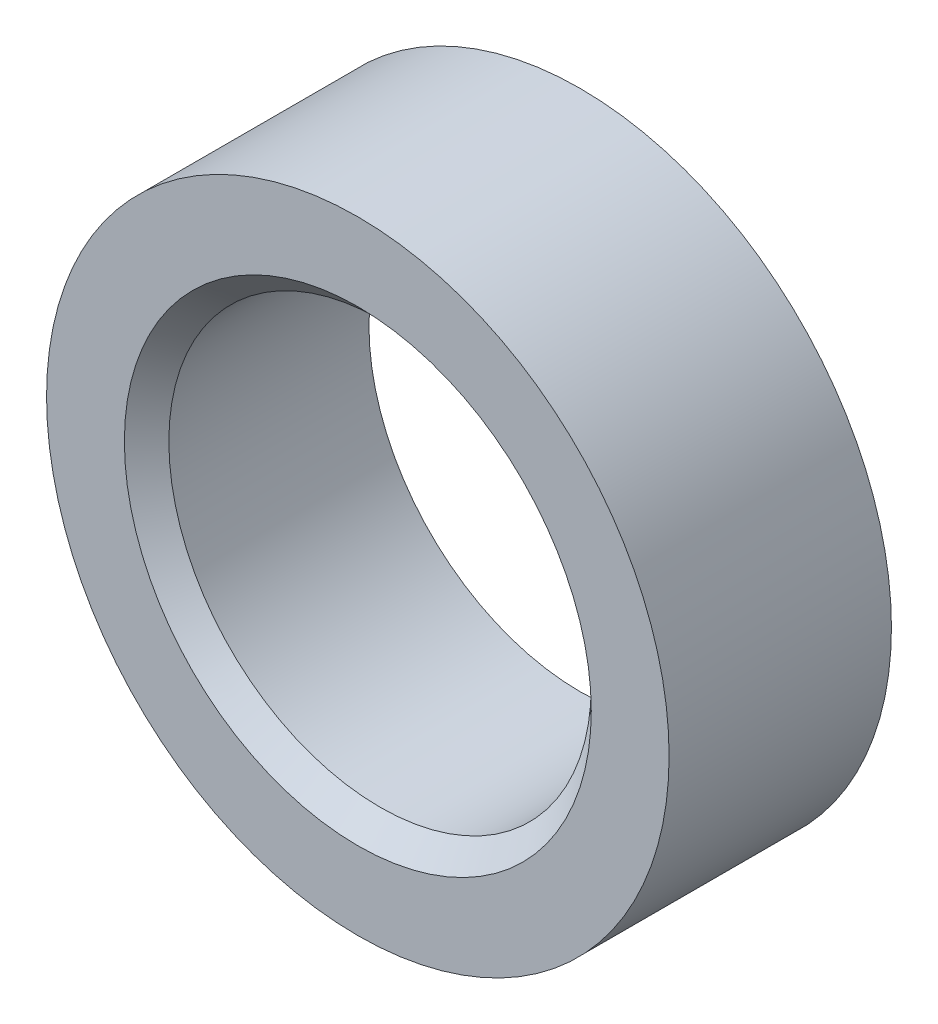
ISO-10303-21;
HEADER;
FILE_DESCRIPTION(('STEP AP214'),'2;1');
FILE_NAME('part.step','',(''),(''),'','','');
FILE_SCHEMA(('AUTOMOTIVE_DESIGN { 1 0 10303 214 1 1 1 1 }'));
ENDSEC;
DATA;
#1=APPLICATION_CONTEXT('core data for automotive mechanical design processes');
#2=APPLICATION_PROTOCOL_DEFINITION('international standard','automotive_design',2000,#1);
#3=PRODUCT_CONTEXT('',#1,'mechanical');
#4=PRODUCT('Part','Part','',(#3));
#5=PRODUCT_RELATED_PRODUCT_CATEGORY('part','',(#4));
#6=PRODUCT_DEFINITION_FORMATION('','',#4);
#7=PRODUCT_DEFINITION_CONTEXT('part definition',#1,'design');
#8=PRODUCT_DEFINITION('design','',#6,#7);
#9=PRODUCT_DEFINITION_SHAPE('','',#8);
#10=(LENGTH_UNIT() NAMED_UNIT(*) SI_UNIT(.MILLI.,.METRE.));
#11=(NAMED_UNIT(*) PLANE_ANGLE_UNIT() SI_UNIT($,.RADIAN.));
#12=(NAMED_UNIT(*) SI_UNIT($,.STERADIAN.) SOLID_ANGLE_UNIT());
#13=UNCERTAINTY_MEASURE_WITH_UNIT(LENGTH_MEASURE(1.E-05),#10,'distance_accuracy_value','');
#14=(GEOMETRIC_REPRESENTATION_CONTEXT(3) GLOBAL_UNCERTAINTY_ASSIGNED_CONTEXT((#13)) GLOBAL_UNIT_ASSIGNED_CONTEXT((#10,
#11,#12)) REPRESENTATION_CONTEXT('',''));
#15=CARTESIAN_POINT('',(0.,0.,0.));
#16=DIRECTION('',(0.,0.,1.));
#17=DIRECTION('',(1.,0.,0.));
#18=AXIS2_PLACEMENT_3D('',#15,#16,#17);
#19=CARTESIAN_POINT('',(0.,0.,10.));
#20=DIRECTION('',(0.,0.,1.));
#21=DIRECTION('',(1.,0.,0.));
#22=AXIS2_PLACEMENT_3D('',#19,#20,#21);
#23=PLANE('',#22);
#24=CARTESIAN_POINT('',(0.,0.,10.));
#25=DIRECTION('',(0.,0.,1.));
#26=DIRECTION('',(1.,0.,0.));
#27=AXIS2_PLACEMENT_3D('',#24,#25,#26);
#28=CIRCLE('',#27,10.5);
#29=CARTESIAN_POINT('',(10.5,0.,10.));
#30=VERTEX_POINT('',#29);
#31=EDGE_CURVE('E10',#30,#30,#28,.F.);
#32=ORIENTED_EDGE('',*,*,#31,.T.);
#33=EDGE_LOOP('',(#32));
#34=FACE_BOUND('',#33,.T.);
#35=CARTESIAN_POINT('',(0.,0.,10.));
#36=DIRECTION('',(0.,0.,1.));
#37=DIRECTION('',(1.,0.,0.));
#38=AXIS2_PLACEMENT_3D('',#35,#36,#37);
#39=CIRCLE('',#38,14.);
#40=CARTESIAN_POINT('',(14.,0.,10.));
#41=VERTEX_POINT('',#40);
#42=EDGE_CURVE('E42',#41,#41,#39,.T.);
#43=ORIENTED_EDGE('',*,*,#42,.T.);
#44=EDGE_LOOP('',(#43));
#45=FACE_BOUND('',#44,.T.);
#46=ADVANCED_FACE('F31',(#34,#45),#23,.T.);
#47=CARTESIAN_POINT('',(0.,0.,0.));
#48=DIRECTION('',(0.,0.,1.));
#49=DIRECTION('',(1.,0.,0.));
#50=AXIS2_PLACEMENT_3D('',#47,#48,#49);
#51=PLANE('',#50);
#52=CARTESIAN_POINT('',(0.,0.,0.));
#53=DIRECTION('',(0.,0.,1.));
#54=DIRECTION('',(1.,0.,0.));
#55=AXIS2_PLACEMENT_3D('',#52,#53,#54);
#56=CIRCLE('',#55,14.);
#57=CARTESIAN_POINT('',(14.,0.,0.));
#58=VERTEX_POINT('',#57);
#59=EDGE_CURVE('E46',#58,#58,#56,.T.);
#60=ORIENTED_EDGE('',*,*,#59,.F.);
#61=EDGE_LOOP('',(#60));
#62=FACE_BOUND('',#61,.T.);
#63=CARTESIAN_POINT('',(0.,0.,0.));
#64=DIRECTION('',(0.,0.,1.));
#65=DIRECTION('',(1.,0.,0.));
#66=AXIS2_PLACEMENT_3D('',#63,#64,#65);
#67=CIRCLE('',#66,9.5);
#68=CARTESIAN_POINT('',(9.5,0.,0.));
#69=VERTEX_POINT('',#68);
#70=EDGE_CURVE('E50',#69,#69,#67,.T.);
#71=ORIENTED_EDGE('',*,*,#70,.T.);
#72=EDGE_LOOP('',(#71));
#73=FACE_BOUND('',#72,.T.);
#74=ADVANCED_FACE('F55',(#62,#73),#51,.F.);
#75=CARTESIAN_POINT('',(0.,0.,10.));
#76=DIRECTION('',(0.,0.,-1.));
#77=DIRECTION('',(-1.,0.,0.));
#78=AXIS2_PLACEMENT_3D('',#75,#76,#77);
#79=CYLINDRICAL_SURFACE('',#78,14.);
#80=ORIENTED_EDGE('',*,*,#42,.F.);
#81=EDGE_LOOP('',(#80));
#82=FACE_BOUND('',#81,.T.);
#83=ORIENTED_EDGE('',*,*,#59,.T.);
#84=EDGE_LOOP('',(#83));
#85=FACE_BOUND('',#84,.T.);
#86=ADVANCED_FACE('F59',(#82,#85),#79,.T.);
#87=CARTESIAN_POINT('',(0.,0.,10.));
#88=DIRECTION('',(0.,0.,-1.));
#89=DIRECTION('',(-1.,0.,0.));
#90=AXIS2_PLACEMENT_3D('',#87,#88,#89);
#91=CYLINDRICAL_SURFACE('',#90,9.5);
#92=CARTESIAN_POINT('',(0.,0.,8.99999999999999));
#93=DIRECTION('',(0.,0.,1.));
#94=DIRECTION('',(1.,0.,0.));
#95=AXIS2_PLACEMENT_3D('',#92,#93,#94);
#96=CIRCLE('',#95,9.5);
#97=CARTESIAN_POINT('',(9.5,0.,8.99999999999999));
#98=VERTEX_POINT('',#97);
#99=EDGE_CURVE('E38',#98,#98,#96,.T.);
#100=ORIENTED_EDGE('',*,*,#99,.T.);
#101=EDGE_LOOP('',(#100));
#102=FACE_BOUND('',#101,.T.);
#103=ORIENTED_EDGE('',*,*,#70,.F.);
#104=EDGE_LOOP('',(#103));
#105=FACE_BOUND('',#104,.T.);
#106=ADVANCED_FACE('F57',(#102,#105),#91,.F.);
#107=CARTESIAN_POINT('',(0.,0.,8.99999999999999));
#108=DIRECTION('',(0.,0.,1.));
#109=DIRECTION('',(1.,0.,0.));
#110=AXIS2_PLACEMENT_3D('',#107,#108,#109);
#111=CONICAL_SURFACE('',#110,9.5,0.785398163397449);
#112=ORIENTED_EDGE('',*,*,#31,.F.);
#113=EDGE_LOOP('',(#112));
#114=FACE_BOUND('',#113,.T.);
#115=ORIENTED_EDGE('',*,*,#99,.F.);
#116=EDGE_LOOP('',(#115));
#117=FACE_BOUND('',#116,.T.);
#118=ADVANCED_FACE('F33',(#114,#117),#111,.F.);
#119=CLOSED_SHELL('',(#46,#74,#86,#106,#118));
#120=MANIFOLD_SOLID_BREP('B2',#119);
#121=ADVANCED_BREP_SHAPE_REPRESENTATION('',(#18,#120),#14);
#122=SHAPE_DEFINITION_REPRESENTATION(#9,#121);
ENDSEC;
END-ISO-10303-21;
